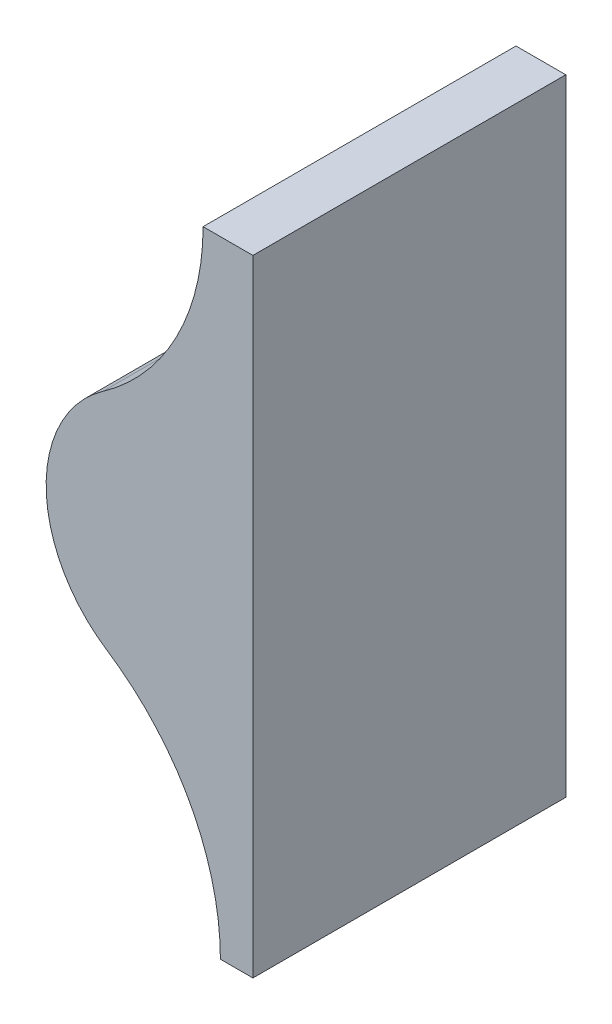
ISO-10303-21;
HEADER;
FILE_DESCRIPTION(('STEP AP214'),'2;1');
FILE_NAME('part.step','',(''),(''),'','','');
FILE_SCHEMA(('AUTOMOTIVE_DESIGN { 1 0 10303 214 1 1 1 1 }'));
ENDSEC;
DATA;
#1=APPLICATION_CONTEXT('core data for automotive mechanical design processes');
#2=APPLICATION_PROTOCOL_DEFINITION('international standard','automotive_design',2000,#1);
#3=PRODUCT_CONTEXT('',#1,'mechanical');
#4=PRODUCT('Part','Part','',(#3));
#5=PRODUCT_RELATED_PRODUCT_CATEGORY('part','',(#4));
#6=PRODUCT_DEFINITION_FORMATION('','',#4);
#7=PRODUCT_DEFINITION_CONTEXT('part definition',#1,'design');
#8=PRODUCT_DEFINITION('design','',#6,#7);
#9=PRODUCT_DEFINITION_SHAPE('','',#8);
#10=(LENGTH_UNIT() NAMED_UNIT(*) SI_UNIT(.MILLI.,.METRE.));
#11=(NAMED_UNIT(*) PLANE_ANGLE_UNIT() SI_UNIT($,.RADIAN.));
#12=(NAMED_UNIT(*) SI_UNIT($,.STERADIAN.) SOLID_ANGLE_UNIT());
#13=UNCERTAINTY_MEASURE_WITH_UNIT(LENGTH_MEASURE(1.E-05),#10,'distance_accuracy_value','');
#14=(GEOMETRIC_REPRESENTATION_CONTEXT(3) GLOBAL_UNCERTAINTY_ASSIGNED_CONTEXT((#13)) GLOBAL_UNIT_ASSIGNED_CONTEXT((#10,
#11,#12)) REPRESENTATION_CONTEXT('',''));
#15=CARTESIAN_POINT('',(0.,0.,0.));
#16=DIRECTION('',(0.,0.,1.));
#17=DIRECTION('',(1.,0.,0.));
#18=AXIS2_PLACEMENT_3D('',#15,#16,#17);
#19=CARTESIAN_POINT('',(-7.91406873118738,0.,76.2));
#20=DIRECTION('',(0.,1.,0.));
#21=DIRECTION('',(-1.,0.,0.));
#22=AXIS2_PLACEMENT_3D('',#19,#20,#21);
#23=PLANE('',#22);
#24=DIRECTION('',(1.,0.,0.));
#25=VECTOR('',#24,1.);
#26=CARTESIAN_POINT('',(-7.91406873118738,0.,0.));
#27=LINE('',#26,#25);
#28=CARTESIAN_POINT('',(-7.91406873118738,0.,0.));
#29=VERTEX_POINT('',#28);
#30=CARTESIAN_POINT('',(0.,0.,0.));
#31=VERTEX_POINT('',#30);
#32=EDGE_CURVE('E117',#29,#31,#27,.T.);
#33=ORIENTED_EDGE('',*,*,#32,.T.);
#34=DIRECTION('',(0.,0.,-1.));
#35=VECTOR('',#34,1.);
#36=CARTESIAN_POINT('',(0.,0.,76.2));
#37=LINE('',#36,#35);
#38=CARTESIAN_POINT('',(0.,0.,76.2));
#39=VERTEX_POINT('',#38);
#40=EDGE_CURVE('E11',#39,#31,#37,.T.);
#41=ORIENTED_EDGE('',*,*,#40,.F.);
#42=DIRECTION('',(1.,0.,0.));
#43=VECTOR('',#42,1.);
#44=CARTESIAN_POINT('',(-7.91406873118738,0.,76.2));
#45=LINE('',#44,#43);
#46=CARTESIAN_POINT('',(-7.91406873118738,0.,76.2));
#47=VERTEX_POINT('',#46);
#48=EDGE_CURVE('E127',#47,#39,#45,.T.);
#49=ORIENTED_EDGE('',*,*,#48,.F.);
#50=DIRECTION('',(0.,0.,-1.));
#51=VECTOR('',#50,1.);
#52=CARTESIAN_POINT('',(-7.91406873118738,0.,76.2));
#53=LINE('',#52,#51);
#54=EDGE_CURVE('E113',#47,#29,#53,.T.);
#55=ORIENTED_EDGE('',*,*,#54,.T.);
#56=EDGE_LOOP('',(#33,#41,#49,#55));
#57=FACE_BOUND('',#56,.T.);
#58=ADVANCED_FACE('F33',(#57),#23,.F.);
#59=CARTESIAN_POINT('',(0.,0.,76.2));
#60=DIRECTION('',(-1.,0.,0.));
#61=DIRECTION('',(0.,0.,1.));
#62=AXIS2_PLACEMENT_3D('',#59,#60,#61);
#63=PLANE('',#62);
#64=DIRECTION('',(0.,1.,0.));
#65=VECTOR('',#64,1.);
#66=CARTESIAN_POINT('',(0.,0.,0.));
#67=LINE('',#66,#65);
#68=CARTESIAN_POINT('',(0.,152.4,0.));
#69=VERTEX_POINT('',#68);
#70=EDGE_CURVE('E120',#31,#69,#67,.T.);
#71=ORIENTED_EDGE('',*,*,#70,.T.);
#72=DIRECTION('',(0.,0.,-1.));
#73=VECTOR('',#72,1.);
#74=CARTESIAN_POINT('',(0.,152.4,76.2));
#75=LINE('',#74,#73);
#76=CARTESIAN_POINT('',(0.,152.4,76.2));
#77=VERTEX_POINT('',#76);
#78=EDGE_CURVE('E41',#77,#69,#75,.T.);
#79=ORIENTED_EDGE('',*,*,#78,.F.);
#80=DIRECTION('',(0.,1.,0.));
#81=VECTOR('',#80,1.);
#82=CARTESIAN_POINT('',(0.,0.,76.2));
#83=LINE('',#82,#81);
#84=EDGE_CURVE('E86',#39,#77,#83,.T.);
#85=ORIENTED_EDGE('',*,*,#84,.F.);
#86=ORIENTED_EDGE('',*,*,#40,.T.);
#87=EDGE_LOOP('',(#71,#79,#85,#86));
#88=FACE_BOUND('',#87,.T.);
#89=ADVANCED_FACE('F151',(#88),#63,.F.);
#90=CARTESIAN_POINT('',(0.,152.4,76.2));
#91=DIRECTION('',(0.,-1.,0.));
#92=DIRECTION('',(1.,0.,0.));
#93=AXIS2_PLACEMENT_3D('',#90,#91,#92);
#94=PLANE('',#93);
#95=DIRECTION('',(-1.,0.,0.));
#96=VECTOR('',#95,1.);
#97=CARTESIAN_POINT('',(0.,152.4,0.));
#98=LINE('',#97,#96);
#99=CARTESIAN_POINT('',(-12.129685679793,152.4,0.));
#100=VERTEX_POINT('',#99);
#101=EDGE_CURVE('E122',#69,#100,#98,.T.);
#102=ORIENTED_EDGE('',*,*,#101,.T.);
#103=DIRECTION('',(0.,0.,-1.));
#104=VECTOR('',#103,1.);
#105=CARTESIAN_POINT('',(-12.129685679793,152.4,76.2));
#106=LINE('',#105,#104);
#107=CARTESIAN_POINT('',(-12.129685679793,152.4,76.2));
#108=VERTEX_POINT('',#107);
#109=EDGE_CURVE('E108',#108,#100,#106,.T.);
#110=ORIENTED_EDGE('',*,*,#109,.F.);
#111=DIRECTION('',(-1.,0.,0.));
#112=VECTOR('',#111,1.);
#113=CARTESIAN_POINT('',(0.,152.4,76.2));
#114=LINE('',#113,#112);
#115=EDGE_CURVE('E99',#77,#108,#114,.T.);
#116=ORIENTED_EDGE('',*,*,#115,.F.);
#117=ORIENTED_EDGE('',*,*,#78,.T.);
#118=EDGE_LOOP('',(#102,#110,#116,#117));
#119=FACE_BOUND('',#118,.T.);
#120=ADVANCED_FACE('F133',(#119),#94,.F.);
#121=CARTESIAN_POINT('',(-69.4616097396237,152.4,76.2));
#122=DIRECTION('',(0.,0.,-1.));
#123=DIRECTION('',(-1.,0.,0.));
#124=AXIS2_PLACEMENT_3D('',#121,#122,#123);
#125=CYLINDRICAL_SURFACE('',#124,57.3319240598307);
#126=CARTESIAN_POINT('',(-69.4616097396237,152.4,0.));
#127=DIRECTION('',(0.,0.,-1.));
#128=DIRECTION('',(-1.,0.,0.));
#129=AXIS2_PLACEMENT_3D('',#126,#127,#128);
#130=CIRCLE('',#129,57.3319240598307);
#131=CARTESIAN_POINT('',(-36.4590221537244,105.519527209751,0.));
#132=VERTEX_POINT('',#131);
#133=EDGE_CURVE('E107',#100,#132,#130,.T.);
#134=ORIENTED_EDGE('',*,*,#133,.T.);
#135=DIRECTION('',(0.,0.,-1.));
#136=VECTOR('',#135,1.);
#137=CARTESIAN_POINT('',(-36.4590221537244,105.519527209751,76.2));
#138=LINE('',#137,#136);
#139=CARTESIAN_POINT('',(-36.4590221537244,105.519527209751,76.2));
#140=VERTEX_POINT('',#139);
#141=EDGE_CURVE('E104',#140,#132,#138,.T.);
#142=ORIENTED_EDGE('',*,*,#141,.F.);
#143=CARTESIAN_POINT('',(-69.4616097396237,152.4,76.2));
#144=DIRECTION('',(0.,0.,-1.));
#145=DIRECTION('',(-1.,0.,0.));
#146=AXIS2_PLACEMENT_3D('',#143,#144,#145);
#147=CIRCLE('',#146,57.3319240598307);
#148=EDGE_CURVE('E93',#108,#140,#147,.T.);
#149=ORIENTED_EDGE('',*,*,#148,.F.);
#150=ORIENTED_EDGE('',*,*,#109,.T.);
#151=EDGE_LOOP('',(#134,#142,#149,#150));
#152=FACE_BOUND('',#151,.T.);
#153=ADVANCED_FACE('F105',(#152),#125,.F.);
#154=CARTESIAN_POINT('',(-17.6138358075481,78.7497703405487,76.2));
#155=DIRECTION('',(0.,0.,-1.));
#156=DIRECTION('',(-1.,0.,0.));
#157=AXIS2_PLACEMENT_3D('',#154,#155,#156);
#158=CYLINDRICAL_SURFACE('',#157,32.7377600220042);
#159=CARTESIAN_POINT('',(-17.6138358075481,78.7497703405487,0.));
#160=DIRECTION('',(0.,0.,1.));
#161=DIRECTION('',(1.,0.,0.));
#162=AXIS2_PLACEMENT_3D('',#159,#160,#161);
#163=CIRCLE('',#162,32.7377600220042);
#164=CARTESIAN_POINT('',(-35.6164296595358,51.4062602173274,0.));
#165=VERTEX_POINT('',#164);
#166=EDGE_CURVE('E72',#132,#165,#163,.T.);
#167=ORIENTED_EDGE('',*,*,#166,.T.);
#168=DIRECTION('',(0.,0.,-1.));
#169=VECTOR('',#168,1.);
#170=CARTESIAN_POINT('',(-35.6164296595358,51.4062602173274,76.2));
#171=LINE('',#170,#169);
#172=CARTESIAN_POINT('',(-35.6164296595358,51.4062602173274,76.2));
#173=VERTEX_POINT('',#172);
#174=EDGE_CURVE('E109',#173,#165,#171,.T.);
#175=ORIENTED_EDGE('',*,*,#174,.F.);
#176=CARTESIAN_POINT('',(-17.6138358075481,78.7497703405487,76.2));
#177=DIRECTION('',(0.,0.,1.));
#178=DIRECTION('',(1.,0.,0.));
#179=AXIS2_PLACEMENT_3D('',#176,#177,#178);
#180=CIRCLE('',#179,32.7377600220042);
#181=EDGE_CURVE('E97',#140,#173,#180,.T.);
#182=ORIENTED_EDGE('',*,*,#181,.F.);
#183=ORIENTED_EDGE('',*,*,#141,.T.);
#184=EDGE_LOOP('',(#167,#175,#182,#183));
#185=FACE_BOUND('',#184,.T.);
#186=ADVANCED_FACE('F111',(#185),#158,.T.);
#187=CARTESIAN_POINT('',(-69.4616097396237,0.,76.2));
#188=DIRECTION('',(0.,0.,-1.));
#189=DIRECTION('',(-1.,0.,0.));
#190=AXIS2_PLACEMENT_3D('',#187,#188,#189);
#191=CYLINDRICAL_SURFACE('',#190,61.5475410084364);
#192=CARTESIAN_POINT('',(-69.4616097396237,0.,0.));
#193=DIRECTION('',(0.,0.,-1.));
#194=DIRECTION('',(-1.,0.,0.));
#195=AXIS2_PLACEMENT_3D('',#192,#193,#194);
#196=CIRCLE('',#195,61.5475410084364);
#197=EDGE_CURVE('E78',#165,#29,#196,.T.);
#198=ORIENTED_EDGE('',*,*,#197,.T.);
#199=ORIENTED_EDGE('',*,*,#54,.F.);
#200=CARTESIAN_POINT('',(-69.4616097396237,0.,76.2));
#201=DIRECTION('',(0.,0.,-1.));
#202=DIRECTION('',(-1.,0.,0.));
#203=AXIS2_PLACEMENT_3D('',#200,#201,#202);
#204=CIRCLE('',#203,61.5475410084364);
#205=EDGE_CURVE('E49',#173,#47,#204,.T.);
#206=ORIENTED_EDGE('',*,*,#205,.F.);
#207=ORIENTED_EDGE('',*,*,#174,.T.);
#208=EDGE_LOOP('',(#198,#199,#206,#207));
#209=FACE_BOUND('',#208,.T.);
#210=ADVANCED_FACE('F140',(#209),#191,.F.);
#211=CARTESIAN_POINT('',(-69.4616097396237,152.4,76.2));
#212=DIRECTION('',(0.,0.,-1.));
#213=DIRECTION('',(-1.,0.,0.));
#214=AXIS2_PLACEMENT_3D('',#211,#212,#213);
#215=PLANE('',#214);
#216=ORIENTED_EDGE('',*,*,#48,.T.);
#217=ORIENTED_EDGE('',*,*,#84,.T.);
#218=ORIENTED_EDGE('',*,*,#115,.T.);
#219=ORIENTED_EDGE('',*,*,#148,.T.);
#220=ORIENTED_EDGE('',*,*,#181,.T.);
#221=ORIENTED_EDGE('',*,*,#205,.T.);
#222=EDGE_LOOP('',(#216,#217,#218,#219,#220,#221));
#223=FACE_BOUND('',#222,.T.);
#224=ADVANCED_FACE('F95',(#223),#215,.F.);
#225=CARTESIAN_POINT('',(-69.4616097396237,152.4,0.));
#226=DIRECTION('',(0.,0.,-1.));
#227=DIRECTION('',(-1.,0.,0.));
#228=AXIS2_PLACEMENT_3D('',#225,#226,#227);
#229=PLANE('',#228);
#230=ORIENTED_EDGE('',*,*,#32,.F.);
#231=ORIENTED_EDGE('',*,*,#197,.F.);
#232=ORIENTED_EDGE('',*,*,#166,.F.);
#233=ORIENTED_EDGE('',*,*,#133,.F.);
#234=ORIENTED_EDGE('',*,*,#101,.F.);
#235=ORIENTED_EDGE('',*,*,#70,.F.);
#236=EDGE_LOOP('',(#230,#231,#232,#233,#234,#235));
#237=FACE_BOUND('',#236,.T.);
#238=ADVANCED_FACE('F136',(#237),#229,.T.);
#239=CLOSED_SHELL('',(#58,#89,#120,#153,#186,#210,#224,#238));
#240=MANIFOLD_SOLID_BREP('B2',#239);
#241=ADVANCED_BREP_SHAPE_REPRESENTATION('',(#18,#240),#14);
#242=SHAPE_DEFINITION_REPRESENTATION(#9,#241);
ENDSEC;
END-ISO-10303-21;
